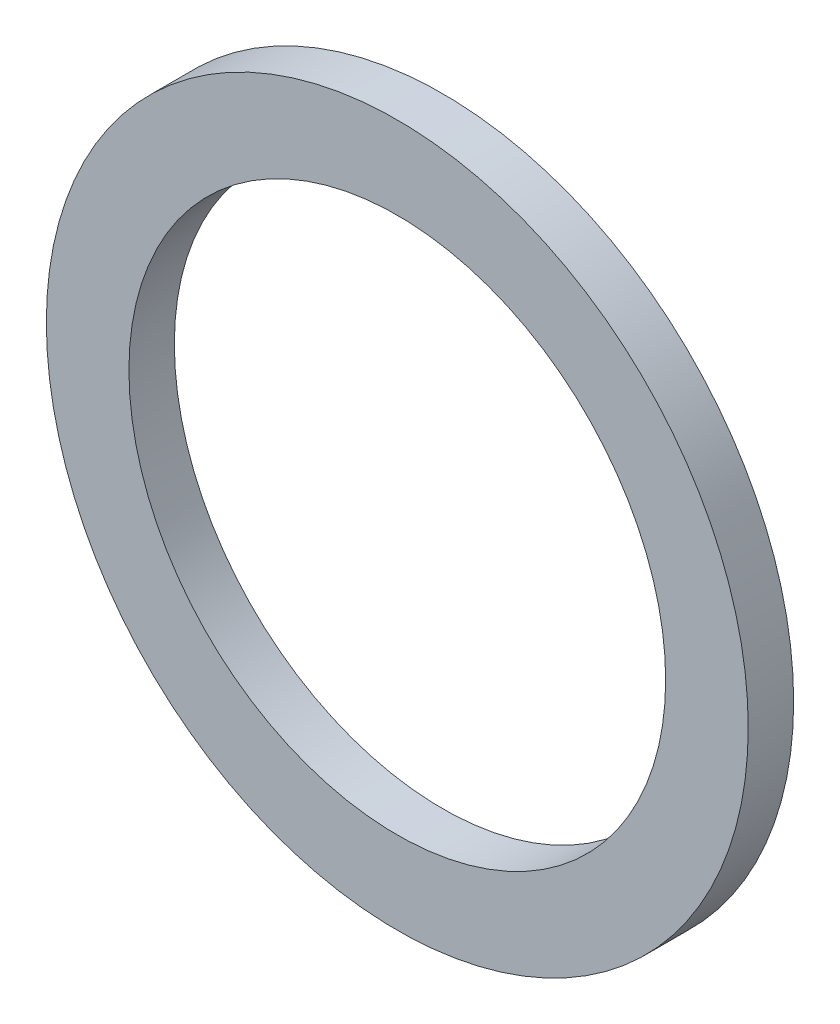
ISO-10303-21;
HEADER;
FILE_DESCRIPTION(('STEP AP214'),'2;1');
FILE_NAME('part.step','',(''),(''),'','','');
FILE_SCHEMA(('AUTOMOTIVE_DESIGN { 1 0 10303 214 1 1 1 1 }'));
ENDSEC;
DATA;
#1=APPLICATION_CONTEXT('core data for automotive mechanical design processes');
#2=APPLICATION_PROTOCOL_DEFINITION('international standard','automotive_design',2000,#1);
#3=PRODUCT_CONTEXT('',#1,'mechanical');
#4=PRODUCT('Part','Part','',(#3));
#5=PRODUCT_RELATED_PRODUCT_CATEGORY('part','',(#4));
#6=PRODUCT_DEFINITION_FORMATION('','',#4);
#7=PRODUCT_DEFINITION_CONTEXT('part definition',#1,'design');
#8=PRODUCT_DEFINITION('design','',#6,#7);
#9=PRODUCT_DEFINITION_SHAPE('','',#8);
#10=(LENGTH_UNIT() NAMED_UNIT(*) SI_UNIT(.MILLI.,.METRE.));
#11=(NAMED_UNIT(*) PLANE_ANGLE_UNIT() SI_UNIT($,.RADIAN.));
#12=(NAMED_UNIT(*) SI_UNIT($,.STERADIAN.) SOLID_ANGLE_UNIT());
#13=UNCERTAINTY_MEASURE_WITH_UNIT(LENGTH_MEASURE(1.E-05),#10,'distance_accuracy_value','');
#14=(GEOMETRIC_REPRESENTATION_CONTEXT(3) GLOBAL_UNCERTAINTY_ASSIGNED_CONTEXT((#13)) GLOBAL_UNIT_ASSIGNED_CONTEXT((#10,
#11,#12)) REPRESENTATION_CONTEXT('',''));
#15=CARTESIAN_POINT('',(0.,0.,0.));
#16=DIRECTION('',(0.,0.,1.));
#17=DIRECTION('',(1.,0.,0.));
#18=AXIS2_PLACEMENT_3D('',#15,#16,#17);
#19=CARTESIAN_POINT('',(0.,0.,-0.5588));
#20=DIRECTION('',(0.,0.,1.));
#21=DIRECTION('',(1.,0.,0.));
#22=AXIS2_PLACEMENT_3D('',#19,#20,#21);
#23=CYLINDRICAL_SURFACE('',#22,4.318);
#24=CARTESIAN_POINT('',(0.,0.,-0.5588));
#25=DIRECTION('',(0.,0.,1.));
#26=DIRECTION('',(1.,0.,0.));
#27=AXIS2_PLACEMENT_3D('',#24,#25,#26);
#28=CIRCLE('',#27,4.318);
#29=CARTESIAN_POINT('',(4.318,0.,-0.5588));
#30=VERTEX_POINT('',#29);
#31=EDGE_CURVE('E10',#30,#30,#28,.T.);
#32=ORIENTED_EDGE('',*,*,#31,.T.);
#33=EDGE_LOOP('',(#32));
#34=FACE_BOUND('',#33,.T.);
#35=CARTESIAN_POINT('',(0.,0.,0.));
#36=DIRECTION('',(0.,0.,1.));
#37=DIRECTION('',(1.,0.,0.));
#38=AXIS2_PLACEMENT_3D('',#35,#36,#37);
#39=CIRCLE('',#38,4.318);
#40=CARTESIAN_POINT('',(4.318,0.,0.));
#41=VERTEX_POINT('',#40);
#42=EDGE_CURVE('E33',#41,#41,#39,.T.);
#43=ORIENTED_EDGE('',*,*,#42,.F.);
#44=EDGE_LOOP('',(#43));
#45=FACE_BOUND('',#44,.T.);
#46=ADVANCED_FACE('F30',(#34,#45),#23,.T.);
#47=CARTESIAN_POINT('',(0.,0.,-0.5588));
#48=DIRECTION('',(0.,0.,1.));
#49=DIRECTION('',(1.,0.,0.));
#50=AXIS2_PLACEMENT_3D('',#47,#48,#49);
#51=PLANE('',#50);
#52=CARTESIAN_POINT('',(0.,0.,-0.5588));
#53=DIRECTION('',(0.,0.,1.));
#54=DIRECTION('',(1.,0.,0.));
#55=AXIS2_PLACEMENT_3D('',#52,#53,#54);
#56=CIRCLE('',#55,3.302);
#57=CARTESIAN_POINT('',(3.302,0.,-0.5588));
#58=VERTEX_POINT('',#57);
#59=EDGE_CURVE('E40',#58,#58,#56,.T.);
#60=ORIENTED_EDGE('',*,*,#59,.T.);
#61=EDGE_LOOP('',(#60));
#62=FACE_BOUND('',#61,.T.);
#63=ORIENTED_EDGE('',*,*,#31,.F.);
#64=EDGE_LOOP('',(#63));
#65=FACE_BOUND('',#64,.T.);
#66=ADVANCED_FACE('F48',(#62,#65),#51,.F.);
#67=CARTESIAN_POINT('',(0.,0.,0.));
#68=DIRECTION('',(0.,0.,1.));
#69=DIRECTION('',(1.,0.,0.));
#70=AXIS2_PLACEMENT_3D('',#67,#68,#69);
#71=PLANE('',#70);
#72=CARTESIAN_POINT('',(0.,0.,0.));
#73=DIRECTION('',(0.,0.,1.));
#74=DIRECTION('',(1.,0.,0.));
#75=AXIS2_PLACEMENT_3D('',#72,#73,#74);
#76=CIRCLE('',#75,3.302);
#77=CARTESIAN_POINT('',(3.302,0.,0.));
#78=VERTEX_POINT('',#77);
#79=EDGE_CURVE('E42',#78,#78,#76,.T.);
#80=ORIENTED_EDGE('',*,*,#79,.F.);
#81=EDGE_LOOP('',(#80));
#82=FACE_BOUND('',#81,.T.);
#83=ORIENTED_EDGE('',*,*,#42,.T.);
#84=EDGE_LOOP('',(#83));
#85=FACE_BOUND('',#84,.T.);
#86=ADVANCED_FACE('F54',(#82,#85),#71,.T.);
#87=CARTESIAN_POINT('',(0.,0.,-0.5588));
#88=DIRECTION('',(0.,0.,1.));
#89=DIRECTION('',(1.,0.,0.));
#90=AXIS2_PLACEMENT_3D('',#87,#88,#89);
#91=CYLINDRICAL_SURFACE('',#90,3.302);
#92=ORIENTED_EDGE('',*,*,#59,.F.);
#93=EDGE_LOOP('',(#92));
#94=FACE_BOUND('',#93,.T.);
#95=ORIENTED_EDGE('',*,*,#79,.T.);
#96=EDGE_LOOP('',(#95));
#97=FACE_BOUND('',#96,.T.);
#98=ADVANCED_FACE('F51',(#94,#97),#91,.F.);
#99=CLOSED_SHELL('',(#46,#66,#86,#98));
#100=MANIFOLD_SOLID_BREP('B2',#99);
#101=ADVANCED_BREP_SHAPE_REPRESENTATION('',(#18,#100),#14);
#102=SHAPE_DEFINITION_REPRESENTATION(#9,#101);
ENDSEC;
END-ISO-10303-21;
